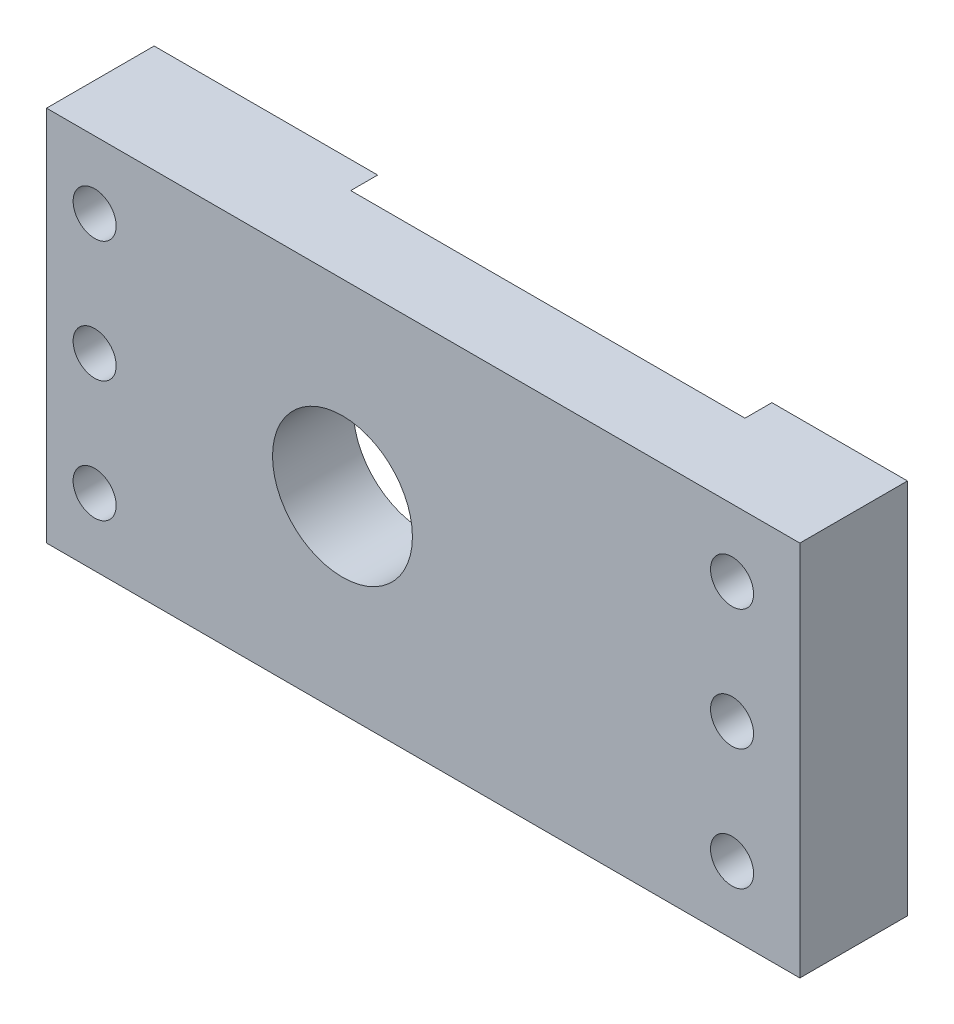
ISO-10303-21;
HEADER;
FILE_DESCRIPTION(('STEP AP214'),'2;1');
FILE_NAME('part.step','',(''),(''),'','','');
FILE_SCHEMA(('AUTOMOTIVE_DESIGN { 1 0 10303 214 1 1 1 1 }'));
ENDSEC;
DATA;
#1=APPLICATION_CONTEXT('core data for automotive mechanical design processes');
#2=APPLICATION_PROTOCOL_DEFINITION('international standard','automotive_design',2000,#1);
#3=PRODUCT_CONTEXT('',#1,'mechanical');
#4=PRODUCT('Part','Part','',(#3));
#5=PRODUCT_RELATED_PRODUCT_CATEGORY('part','',(#4));
#6=PRODUCT_DEFINITION_FORMATION('','',#4);
#7=PRODUCT_DEFINITION_CONTEXT('part definition',#1,'design');
#8=PRODUCT_DEFINITION('design','',#6,#7);
#9=PRODUCT_DEFINITION_SHAPE('','',#8);
#10=(LENGTH_UNIT() NAMED_UNIT(*) SI_UNIT(.MILLI.,.METRE.));
#11=(NAMED_UNIT(*) PLANE_ANGLE_UNIT() SI_UNIT($,.RADIAN.));
#12=(NAMED_UNIT(*) SI_UNIT($,.STERADIAN.) SOLID_ANGLE_UNIT());
#13=UNCERTAINTY_MEASURE_WITH_UNIT(LENGTH_MEASURE(1.E-05),#10,'distance_accuracy_value','');
#14=(GEOMETRIC_REPRESENTATION_CONTEXT(3) GLOBAL_UNCERTAINTY_ASSIGNED_CONTEXT((#13)) GLOBAL_UNIT_ASSIGNED_CONTEXT((#10,
#11,#12)) REPRESENTATION_CONTEXT('',''));
#15=CARTESIAN_POINT('',(0.,0.,0.));
#16=DIRECTION('',(0.,0.,1.));
#17=DIRECTION('',(1.,0.,0.));
#18=AXIS2_PLACEMENT_3D('',#15,#16,#17);
#19=CARTESIAN_POINT('',(0.,0.,-10.));
#20=DIRECTION('',(0.,0.,-1.));
#21=DIRECTION('',(-1.,0.,0.));
#22=AXIS2_PLACEMENT_3D('',#19,#20,#21);
#23=PLANE('',#22);
#24=CARTESIAN_POINT('',(-15.,0.,-10.));
#25=DIRECTION('',(0.,0.,-1.));
#26=DIRECTION('',(-1.,0.,0.));
#27=AXIS2_PLACEMENT_3D('',#24,#25,#26);
#28=CIRCLE('',#27,37.5);
#29=CARTESIAN_POINT('',(-28.4629120178363,-35.,-10.));
#30=VERTEX_POINT('',#29);
#31=CARTESIAN_POINT('',(-28.4629120178363,35.,-10.));
#32=VERTEX_POINT('',#31);
#33=EDGE_CURVE('E121',#30,#32,#28,.T.);
#34=ORIENTED_EDGE('',*,*,#33,.F.);
#35=DIRECTION('',(1.,0.,0.));
#36=VECTOR('',#35,1.);
#37=CARTESIAN_POINT('',(-70.,-35.,-10.));
#38=LINE('',#37,#36);
#39=CARTESIAN_POINT('',(-70.,-35.,-10.));
#40=VERTEX_POINT('',#39);
#41=EDGE_CURVE('E135',#40,#30,#38,.T.);
#42=ORIENTED_EDGE('',*,*,#41,.F.);
#43=DIRECTION('',(0.,-1.,0.));
#44=VECTOR('',#43,1.);
#45=CARTESIAN_POINT('',(-70.,-35.,-10.));
#46=LINE('',#45,#44);
#47=CARTESIAN_POINT('',(-70.,35.,-10.));
#48=VERTEX_POINT('',#47);
#49=EDGE_CURVE('E127',#48,#40,#46,.T.);
#50=ORIENTED_EDGE('',*,*,#49,.F.);
#51=DIRECTION('',(-1.,0.,0.));
#52=VECTOR('',#51,1.);
#53=CARTESIAN_POINT('',(-70.,35.,-10.));
#54=LINE('',#53,#52);
#55=EDGE_CURVE('E128',#32,#48,#54,.T.);
#56=ORIENTED_EDGE('',*,*,#55,.F.);
#57=EDGE_LOOP('',(#34,#42,#50,#56));
#58=FACE_BOUND('',#57,.T.);
#59=CARTESIAN_POINT('',(-61.06,22.5,-10.));
#60=DIRECTION('',(0.,0.,1.));
#61=DIRECTION('',(1.,0.,0.));
#62=AXIS2_PLACEMENT_3D('',#59,#60,#61);
#63=CIRCLE('',#62,4.00000000000001);
#64=CARTESIAN_POINT('',(-57.06,22.5,-10.));
#65=VERTEX_POINT('',#64);
#66=EDGE_CURVE('E172',#65,#65,#63,.T.);
#67=ORIENTED_EDGE('',*,*,#66,.T.);
#68=EDGE_LOOP('',(#67));
#69=FACE_BOUND('',#68,.T.);
#70=CARTESIAN_POINT('',(-61.06,0.,-10.));
#71=DIRECTION('',(0.,0.,1.));
#72=DIRECTION('',(1.,0.,0.));
#73=AXIS2_PLACEMENT_3D('',#70,#71,#72);
#74=CIRCLE('',#73,4.00000000000001);
#75=CARTESIAN_POINT('',(-57.06,0.,-10.));
#76=VERTEX_POINT('',#75);
#77=EDGE_CURVE('E178',#76,#76,#74,.T.);
#78=ORIENTED_EDGE('',*,*,#77,.T.);
#79=EDGE_LOOP('',(#78));
#80=FACE_BOUND('',#79,.T.);
#81=CARTESIAN_POINT('',(-61.06,-22.5,-10.));
#82=DIRECTION('',(0.,0.,1.));
#83=DIRECTION('',(-1.,0.,0.));
#84=AXIS2_PLACEMENT_3D('',#81,#82,#83);
#85=CIRCLE('',#84,4.00000000000001);
#86=CARTESIAN_POINT('',(-65.06,-22.5,-10.));
#87=VERTEX_POINT('',#86);
#88=EDGE_CURVE('E166',#87,#87,#85,.T.);
#89=ORIENTED_EDGE('',*,*,#88,.T.);
#90=EDGE_LOOP('',(#89));
#91=FACE_BOUND('',#90,.T.);
#92=ADVANCED_FACE('F33',(#58,#69,#80,#91),#23,.T.);
#93=CARTESIAN_POINT('',(-15.,0.,10.));
#94=DIRECTION('',(0.,0.,-1.));
#95=DIRECTION('',(-1.,0.,0.));
#96=AXIS2_PLACEMENT_3D('',#93,#94,#95);
#97=CYLINDRICAL_SURFACE('',#96,13.);
#98=CARTESIAN_POINT('',(-15.,0.,10.));
#99=DIRECTION('',(0.,0.,1.));
#100=DIRECTION('',(1.,0.,0.));
#101=AXIS2_PLACEMENT_3D('',#98,#99,#100);
#102=CIRCLE('',#101,13.);
#103=CARTESIAN_POINT('',(-2.00000000000003,0.,10.));
#104=VERTEX_POINT('',#103);
#105=EDGE_CURVE('E196',#104,#104,#102,.T.);
#106=ORIENTED_EDGE('',*,*,#105,.T.);
#107=EDGE_LOOP('',(#106));
#108=FACE_BOUND('',#107,.T.);
#109=CARTESIAN_POINT('',(-15.,0.,-5.));
#110=DIRECTION('',(0.,0.,-1.));
#111=DIRECTION('',(-1.,0.,0.));
#112=AXIS2_PLACEMENT_3D('',#109,#110,#111);
#113=CIRCLE('',#112,13.);
#114=CARTESIAN_POINT('',(-28.,0.,-5.));
#115=VERTEX_POINT('',#114);
#116=EDGE_CURVE('E148',#115,#115,#113,.T.);
#117=ORIENTED_EDGE('',*,*,#116,.T.);
#118=EDGE_LOOP('',(#117));
#119=FACE_BOUND('',#118,.T.);
#120=ADVANCED_FACE('F221',(#108,#119),#97,.F.);
#121=CARTESIAN_POINT('',(0.,0.,10.));
#122=DIRECTION('',(0.,0.,-1.));
#123=DIRECTION('',(-1.,0.,0.));
#124=AXIS2_PLACEMENT_3D('',#121,#122,#123);
#125=PLANE('',#124);
#126=DIRECTION('',(0.,1.,0.));
#127=VECTOR('',#126,1.);
#128=CARTESIAN_POINT('',(70.,-35.,10.));
#129=LINE('',#128,#127);
#130=CARTESIAN_POINT('',(70.,-35.,10.));
#131=VERTEX_POINT('',#130);
#132=CARTESIAN_POINT('',(70.,35.,10.));
#133=VERTEX_POINT('',#132);
#134=EDGE_CURVE('E138',#131,#133,#129,.T.);
#135=ORIENTED_EDGE('',*,*,#134,.T.);
#136=DIRECTION('',(-1.,0.,0.));
#137=VECTOR('',#136,1.);
#138=CARTESIAN_POINT('',(-70.,35.,10.));
#139=LINE('',#138,#137);
#140=CARTESIAN_POINT('',(-70.,35.,10.));
#141=VERTEX_POINT('',#140);
#142=EDGE_CURVE('E86',#133,#141,#139,.T.);
#143=ORIENTED_EDGE('',*,*,#142,.T.);
#144=DIRECTION('',(0.,-1.,0.));
#145=VECTOR('',#144,1.);
#146=CARTESIAN_POINT('',(-70.,-35.,10.));
#147=LINE('',#146,#145);
#148=CARTESIAN_POINT('',(-70.,-35.,10.));
#149=VERTEX_POINT('',#148);
#150=EDGE_CURVE('E203',#141,#149,#147,.T.);
#151=ORIENTED_EDGE('',*,*,#150,.T.);
#152=DIRECTION('',(1.,0.,0.));
#153=VECTOR('',#152,1.);
#154=CARTESIAN_POINT('',(-70.,-35.,10.));
#155=LINE('',#154,#153);
#156=EDGE_CURVE('E57',#149,#131,#155,.T.);
#157=ORIENTED_EDGE('',*,*,#156,.T.);
#158=EDGE_LOOP('',(#135,#143,#151,#157));
#159=FACE_BOUND('',#158,.T.);
#160=ORIENTED_EDGE('',*,*,#105,.F.);
#161=EDGE_LOOP('',(#160));
#162=FACE_BOUND('',#161,.T.);
#163=CARTESIAN_POINT('',(57.4,0.,10.));
#164=DIRECTION('',(0.,0.,1.));
#165=DIRECTION('',(1.,0.,0.));
#166=AXIS2_PLACEMENT_3D('',#163,#164,#165);
#167=CIRCLE('',#166,4.00000000000001);
#168=CARTESIAN_POINT('',(61.4,0.,10.));
#169=VERTEX_POINT('',#168);
#170=EDGE_CURVE('E193',#169,#169,#167,.T.);
#171=ORIENTED_EDGE('',*,*,#170,.F.);
#172=EDGE_LOOP('',(#171));
#173=FACE_BOUND('',#172,.T.);
#174=CARTESIAN_POINT('',(57.4,22.5,10.));
#175=DIRECTION('',(0.,0.,1.));
#176=DIRECTION('',(1.,0.,0.));
#177=AXIS2_PLACEMENT_3D('',#174,#175,#176);
#178=CIRCLE('',#177,4.00000000000001);
#179=CARTESIAN_POINT('',(61.4,22.5,10.));
#180=VERTEX_POINT('',#179);
#181=EDGE_CURVE('E187',#180,#180,#178,.T.);
#182=ORIENTED_EDGE('',*,*,#181,.F.);
#183=EDGE_LOOP('',(#182));
#184=FACE_BOUND('',#183,.T.);
#185=CARTESIAN_POINT('',(-61.06,0.,10.));
#186=DIRECTION('',(0.,0.,1.));
#187=DIRECTION('',(1.,0.,0.));
#188=AXIS2_PLACEMENT_3D('',#185,#186,#187);
#189=CIRCLE('',#188,4.00000000000001);
#190=CARTESIAN_POINT('',(-57.06,0.,10.));
#191=VERTEX_POINT('',#190);
#192=EDGE_CURVE('E181',#191,#191,#189,.T.);
#193=ORIENTED_EDGE('',*,*,#192,.F.);
#194=EDGE_LOOP('',(#193));
#195=FACE_BOUND('',#194,.T.);
#196=CARTESIAN_POINT('',(-61.06,22.5,10.));
#197=DIRECTION('',(0.,0.,1.));
#198=DIRECTION('',(1.,0.,0.));
#199=AXIS2_PLACEMENT_3D('',#196,#197,#198);
#200=CIRCLE('',#199,4.00000000000001);
#201=CARTESIAN_POINT('',(-57.06,22.5,10.));
#202=VERTEX_POINT('',#201);
#203=EDGE_CURVE('E175',#202,#202,#200,.T.);
#204=ORIENTED_EDGE('',*,*,#203,.F.);
#205=EDGE_LOOP('',(#204));
#206=FACE_BOUND('',#205,.T.);
#207=CARTESIAN_POINT('',(-61.06,-22.5,10.));
#208=DIRECTION('',(0.,0.,1.));
#209=DIRECTION('',(-1.,0.,0.));
#210=AXIS2_PLACEMENT_3D('',#207,#208,#209);
#211=CIRCLE('',#210,4.00000000000001);
#212=CARTESIAN_POINT('',(-65.06,-22.5,10.));
#213=VERTEX_POINT('',#212);
#214=EDGE_CURVE('E169',#213,#213,#211,.T.);
#215=ORIENTED_EDGE('',*,*,#214,.F.);
#216=EDGE_LOOP('',(#215));
#217=FACE_BOUND('',#216,.T.);
#218=CARTESIAN_POINT('',(57.4,-22.5,10.));
#219=DIRECTION('',(0.,0.,1.));
#220=DIRECTION('',(-1.,0.,0.));
#221=AXIS2_PLACEMENT_3D('',#218,#219,#220);
#222=CIRCLE('',#221,4.00000000000001);
#223=CARTESIAN_POINT('',(53.4,-22.5,10.));
#224=VERTEX_POINT('',#223);
#225=EDGE_CURVE('E163',#224,#224,#222,.T.);
#226=ORIENTED_EDGE('',*,*,#225,.F.);
#227=EDGE_LOOP('',(#226));
#228=FACE_BOUND('',#227,.T.);
#229=ADVANCED_FACE('F206',(#159,#162,#173,#184,#195,#206,#217,#228),#125,.F.);
#230=DIRECTION('',(0.,-1.,0.));
#231=VECTOR('',#230,1.);
#232=CARTESIAN_POINT('',(44.8,-37.5,-10.));
#233=LINE('',#232,#231);
#234=CARTESIAN_POINT('',(44.8,35.,-10.));
#235=VERTEX_POINT('',#234);
#236=CARTESIAN_POINT('',(44.8,-35.,-10.));
#237=VERTEX_POINT('',#236);
#238=EDGE_CURVE('E110',#235,#237,#233,.T.);
#239=ORIENTED_EDGE('',*,*,#238,.F.);
#240=CARTESIAN_POINT('',(70.,35.,-10.));
#241=VERTEX_POINT('',#240);
#242=EDGE_CURVE('E120',#241,#235,#54,.T.);
#243=ORIENTED_EDGE('',*,*,#242,.F.);
#244=DIRECTION('',(0.,1.,0.));
#245=VECTOR('',#244,1.);
#246=CARTESIAN_POINT('',(70.,-35.,-10.));
#247=LINE('',#246,#245);
#248=CARTESIAN_POINT('',(70.,-35.,-10.));
#249=VERTEX_POINT('',#248);
#250=EDGE_CURVE('E131',#249,#241,#247,.T.);
#251=ORIENTED_EDGE('',*,*,#250,.F.);
#252=EDGE_CURVE('E78',#237,#249,#38,.T.);
#253=ORIENTED_EDGE('',*,*,#252,.F.);
#254=EDGE_LOOP('',(#239,#243,#251,#253));
#255=FACE_BOUND('',#254,.T.);
#256=CARTESIAN_POINT('',(57.4,0.,-10.));
#257=DIRECTION('',(0.,0.,1.));
#258=DIRECTION('',(1.,0.,0.));
#259=AXIS2_PLACEMENT_3D('',#256,#257,#258);
#260=CIRCLE('',#259,4.00000000000001);
#261=CARTESIAN_POINT('',(61.4,0.,-10.));
#262=VERTEX_POINT('',#261);
#263=EDGE_CURVE('E190',#262,#262,#260,.T.);
#264=ORIENTED_EDGE('',*,*,#263,.T.);
#265=EDGE_LOOP('',(#264));
#266=FACE_BOUND('',#265,.T.);
#267=CARTESIAN_POINT('',(57.4,22.5,-10.));
#268=DIRECTION('',(0.,0.,1.));
#269=DIRECTION('',(1.,0.,0.));
#270=AXIS2_PLACEMENT_3D('',#267,#268,#269);
#271=CIRCLE('',#270,4.00000000000001);
#272=CARTESIAN_POINT('',(61.4,22.5,-10.));
#273=VERTEX_POINT('',#272);
#274=EDGE_CURVE('E184',#273,#273,#271,.T.);
#275=ORIENTED_EDGE('',*,*,#274,.T.);
#276=EDGE_LOOP('',(#275));
#277=FACE_BOUND('',#276,.T.);
#278=CARTESIAN_POINT('',(57.4,-22.5,-10.));
#279=DIRECTION('',(0.,0.,1.));
#280=DIRECTION('',(-1.,0.,0.));
#281=AXIS2_PLACEMENT_3D('',#278,#279,#280);
#282=CIRCLE('',#281,4.00000000000001);
#283=CARTESIAN_POINT('',(53.4,-22.5,-10.));
#284=VERTEX_POINT('',#283);
#285=EDGE_CURVE('E162',#284,#284,#282,.T.);
#286=ORIENTED_EDGE('',*,*,#285,.T.);
#287=EDGE_LOOP('',(#286));
#288=FACE_BOUND('',#287,.T.);
#289=ADVANCED_FACE('F117',(#255,#266,#277,#288),#23,.T.);
#290=CARTESIAN_POINT('',(70.,-35.,10.));
#291=DIRECTION('',(-1.,0.,0.));
#292=DIRECTION('',(0.,0.,1.));
#293=AXIS2_PLACEMENT_3D('',#290,#291,#292);
#294=PLANE('',#293);
#295=ORIENTED_EDGE('',*,*,#250,.T.);
#296=DIRECTION('',(0.,0.,-1.));
#297=VECTOR('',#296,1.);
#298=CARTESIAN_POINT('',(70.,35.,10.));
#299=LINE('',#298,#297);
#300=EDGE_CURVE('E125',#133,#241,#299,.T.);
#301=ORIENTED_EDGE('',*,*,#300,.F.);
#302=ORIENTED_EDGE('',*,*,#134,.F.);
#303=DIRECTION('',(0.,0.,-1.));
#304=VECTOR('',#303,1.);
#305=CARTESIAN_POINT('',(70.,-35.,10.));
#306=LINE('',#305,#304);
#307=EDGE_CURVE('E139',#131,#249,#306,.T.);
#308=ORIENTED_EDGE('',*,*,#307,.T.);
#309=EDGE_LOOP('',(#295,#301,#302,#308));
#310=FACE_BOUND('',#309,.T.);
#311=ADVANCED_FACE('F35',(#310),#294,.F.);
#312=CARTESIAN_POINT('',(-70.,35.,10.));
#313=DIRECTION('',(0.,-1.,0.));
#314=DIRECTION('',(0.,0.,-1.));
#315=AXIS2_PLACEMENT_3D('',#312,#313,#314);
#316=PLANE('',#315);
#317=DIRECTION('',(1.,0.,0.));
#318=VECTOR('',#317,1.);
#319=CARTESIAN_POINT('',(-70.,35.,-5.));
#320=LINE('',#319,#318);
#321=CARTESIAN_POINT('',(-28.4629120178363,35.,-5.));
#322=VERTEX_POINT('',#321);
#323=CARTESIAN_POINT('',(44.8,35.,-5.));
#324=VERTEX_POINT('',#323);
#325=EDGE_CURVE('E114',#322,#324,#320,.T.);
#326=ORIENTED_EDGE('',*,*,#325,.F.);
#327=DIRECTION('',(0.,0.,-1.));
#328=VECTOR('',#327,1.);
#329=CARTESIAN_POINT('',(-28.4629120178363,35.,-5.));
#330=LINE('',#329,#328);
#331=EDGE_CURVE('E113',#322,#32,#330,.T.);
#332=ORIENTED_EDGE('',*,*,#331,.T.);
#333=ORIENTED_EDGE('',*,*,#55,.T.);
#334=DIRECTION('',(0.,0.,-1.));
#335=VECTOR('',#334,1.);
#336=CARTESIAN_POINT('',(-70.,35.,10.));
#337=LINE('',#336,#335);
#338=EDGE_CURVE('E144',#141,#48,#337,.T.);
#339=ORIENTED_EDGE('',*,*,#338,.F.);
#340=ORIENTED_EDGE('',*,*,#142,.F.);
#341=ORIENTED_EDGE('',*,*,#300,.T.);
#342=ORIENTED_EDGE('',*,*,#242,.T.);
#343=DIRECTION('',(0.,0.,1.));
#344=VECTOR('',#343,1.);
#345=CARTESIAN_POINT('',(44.8,35.,10.));
#346=LINE('',#345,#344);
#347=EDGE_CURVE('E107',#235,#324,#346,.T.);
#348=ORIENTED_EDGE('',*,*,#347,.T.);
#349=EDGE_LOOP('',(#326,#332,#333,#339,#340,#341,#342,#348));
#350=FACE_BOUND('',#349,.T.);
#351=ADVANCED_FACE('F123',(#350),#316,.F.);
#352=CARTESIAN_POINT('',(-70.,-35.,10.));
#353=DIRECTION('',(1.,0.,0.));
#354=DIRECTION('',(0.,0.,-1.));
#355=AXIS2_PLACEMENT_3D('',#352,#353,#354);
#356=PLANE('',#355);
#357=ORIENTED_EDGE('',*,*,#49,.T.);
#358=DIRECTION('',(0.,0.,-1.));
#359=VECTOR('',#358,1.);
#360=CARTESIAN_POINT('',(-70.,-35.,10.));
#361=LINE('',#360,#359);
#362=EDGE_CURVE('E141',#149,#40,#361,.T.);
#363=ORIENTED_EDGE('',*,*,#362,.F.);
#364=ORIENTED_EDGE('',*,*,#150,.F.);
#365=ORIENTED_EDGE('',*,*,#338,.T.);
#366=EDGE_LOOP('',(#357,#363,#364,#365));
#367=FACE_BOUND('',#366,.T.);
#368=ADVANCED_FACE('F209',(#367),#356,.F.);
#369=CARTESIAN_POINT('',(-70.,-35.,10.));
#370=DIRECTION('',(0.,1.,0.));
#371=DIRECTION('',(0.,0.,1.));
#372=AXIS2_PLACEMENT_3D('',#369,#370,#371);
#373=PLANE('',#372);
#374=ORIENTED_EDGE('',*,*,#41,.T.);
#375=DIRECTION('',(0.,0.,-1.));
#376=VECTOR('',#375,1.);
#377=CARTESIAN_POINT('',(-28.4629120178363,-35.,-5.));
#378=LINE('',#377,#376);
#379=CARTESIAN_POINT('',(-28.4629120178363,-35.,-5.));
#380=VERTEX_POINT('',#379);
#381=EDGE_CURVE('E11',#30,#380,#378,.F.);
#382=ORIENTED_EDGE('',*,*,#381,.T.);
#383=DIRECTION('',(-1.,0.,0.));
#384=VECTOR('',#383,1.);
#385=CARTESIAN_POINT('',(-70.,-35.,-5.));
#386=LINE('',#385,#384);
#387=CARTESIAN_POINT('',(44.8,-35.,-5.));
#388=VERTEX_POINT('',#387);
#389=EDGE_CURVE('E150',#388,#380,#386,.T.);
#390=ORIENTED_EDGE('',*,*,#389,.F.);
#391=DIRECTION('',(0.,0.,-1.));
#392=VECTOR('',#391,1.);
#393=CARTESIAN_POINT('',(44.8,-35.,10.));
#394=LINE('',#393,#392);
#395=EDGE_CURVE('E41',#388,#237,#394,.T.);
#396=ORIENTED_EDGE('',*,*,#395,.T.);
#397=ORIENTED_EDGE('',*,*,#252,.T.);
#398=ORIENTED_EDGE('',*,*,#307,.F.);
#399=ORIENTED_EDGE('',*,*,#156,.F.);
#400=ORIENTED_EDGE('',*,*,#362,.T.);
#401=EDGE_LOOP('',(#374,#382,#390,#396,#397,#398,#399,#400));
#402=FACE_BOUND('',#401,.T.);
#403=ADVANCED_FACE('F153',(#402),#373,.F.);
#404=CARTESIAN_POINT('',(57.4,0.,10.));
#405=DIRECTION('',(0.,0.,-1.));
#406=DIRECTION('',(-1.,0.,0.));
#407=AXIS2_PLACEMENT_3D('',#404,#405,#406);
#408=CYLINDRICAL_SURFACE('',#407,4.00000000000001);
#409=ORIENTED_EDGE('',*,*,#170,.T.);
#410=EDGE_LOOP('',(#409));
#411=FACE_BOUND('',#410,.T.);
#412=ORIENTED_EDGE('',*,*,#263,.F.);
#413=EDGE_LOOP('',(#412));
#414=FACE_BOUND('',#413,.T.);
#415=ADVANCED_FACE('F234',(#411,#414),#408,.F.);
#416=CARTESIAN_POINT('',(57.4,22.5,10.));
#417=DIRECTION('',(0.,0.,-1.));
#418=DIRECTION('',(-1.,0.,0.));
#419=AXIS2_PLACEMENT_3D('',#416,#417,#418);
#420=CYLINDRICAL_SURFACE('',#419,4.00000000000001);
#421=ORIENTED_EDGE('',*,*,#181,.T.);
#422=EDGE_LOOP('',(#421));
#423=FACE_BOUND('',#422,.T.);
#424=ORIENTED_EDGE('',*,*,#274,.F.);
#425=EDGE_LOOP('',(#424));
#426=FACE_BOUND('',#425,.T.);
#427=ADVANCED_FACE('F251',(#423,#426),#420,.F.);
#428=CARTESIAN_POINT('',(-61.06,0.,10.));
#429=DIRECTION('',(0.,0.,-1.));
#430=DIRECTION('',(-1.,0.,0.));
#431=AXIS2_PLACEMENT_3D('',#428,#429,#430);
#432=CYLINDRICAL_SURFACE('',#431,4.00000000000001);
#433=ORIENTED_EDGE('',*,*,#192,.T.);
#434=EDGE_LOOP('',(#433));
#435=FACE_BOUND('',#434,.T.);
#436=ORIENTED_EDGE('',*,*,#77,.F.);
#437=EDGE_LOOP('',(#436));
#438=FACE_BOUND('',#437,.T.);
#439=ADVANCED_FACE('F259',(#435,#438),#432,.F.);
#440=CARTESIAN_POINT('',(-61.06,22.5,10.));
#441=DIRECTION('',(0.,0.,-1.));
#442=DIRECTION('',(-1.,0.,0.));
#443=AXIS2_PLACEMENT_3D('',#440,#441,#442);
#444=CYLINDRICAL_SURFACE('',#443,4.00000000000001);
#445=ORIENTED_EDGE('',*,*,#203,.T.);
#446=EDGE_LOOP('',(#445));
#447=FACE_BOUND('',#446,.T.);
#448=ORIENTED_EDGE('',*,*,#66,.F.);
#449=EDGE_LOOP('',(#448));
#450=FACE_BOUND('',#449,.T.);
#451=ADVANCED_FACE('F267',(#447,#450),#444,.F.);
#452=CARTESIAN_POINT('',(-61.06,-22.5,10.));
#453=DIRECTION('',(0.,0.,-1.));
#454=DIRECTION('',(-1.,0.,0.));
#455=AXIS2_PLACEMENT_3D('',#452,#453,#454);
#456=CYLINDRICAL_SURFACE('',#455,4.00000000000001);
#457=ORIENTED_EDGE('',*,*,#214,.T.);
#458=EDGE_LOOP('',(#457));
#459=FACE_BOUND('',#458,.T.);
#460=ORIENTED_EDGE('',*,*,#88,.F.);
#461=EDGE_LOOP('',(#460));
#462=FACE_BOUND('',#461,.T.);
#463=ADVANCED_FACE('F275',(#459,#462),#456,.F.);
#464=CARTESIAN_POINT('',(57.4,-22.5,10.));
#465=DIRECTION('',(0.,0.,-1.));
#466=DIRECTION('',(-1.,0.,0.));
#467=AXIS2_PLACEMENT_3D('',#464,#465,#466);
#468=CYLINDRICAL_SURFACE('',#467,4.00000000000001);
#469=ORIENTED_EDGE('',*,*,#225,.T.);
#470=EDGE_LOOP('',(#469));
#471=FACE_BOUND('',#470,.T.);
#472=ORIENTED_EDGE('',*,*,#285,.F.);
#473=EDGE_LOOP('',(#472));
#474=FACE_BOUND('',#473,.T.);
#475=ADVANCED_FACE('F283',(#471,#474),#468,.F.);
#476=CARTESIAN_POINT('',(-15.,0.,-5.));
#477=DIRECTION('',(0.,0.,-1.));
#478=DIRECTION('',(-1.,0.,0.));
#479=AXIS2_PLACEMENT_3D('',#476,#477,#478);
#480=CYLINDRICAL_SURFACE('',#479,37.5);
#481=CARTESIAN_POINT('',(-15.,0.,-5.));
#482=DIRECTION('',(0.,0.,-1.));
#483=DIRECTION('',(-1.,0.,0.));
#484=AXIS2_PLACEMENT_3D('',#481,#482,#483);
#485=CIRCLE('',#484,37.5);
#486=EDGE_CURVE('E151',#380,#322,#485,.T.);
#487=ORIENTED_EDGE('',*,*,#486,.F.);
#488=ORIENTED_EDGE('',*,*,#381,.F.);
#489=ORIENTED_EDGE('',*,*,#33,.T.);
#490=ORIENTED_EDGE('',*,*,#331,.F.);
#491=EDGE_LOOP('',(#487,#488,#489,#490));
#492=FACE_BOUND('',#491,.T.);
#493=ADVANCED_FACE('F291',(#492),#480,.F.);
#494=CARTESIAN_POINT('',(44.8,-37.5,-5.));
#495=DIRECTION('',(1.,0.,0.));
#496=DIRECTION('',(0.,0.,-1.));
#497=AXIS2_PLACEMENT_3D('',#494,#495,#496);
#498=PLANE('',#497);
#499=ORIENTED_EDGE('',*,*,#238,.T.);
#500=ORIENTED_EDGE('',*,*,#395,.F.);
#501=DIRECTION('',(0.,-1.,0.));
#502=VECTOR('',#501,1.);
#503=CARTESIAN_POINT('',(44.8,-37.5,-5.));
#504=LINE('',#503,#502);
#505=EDGE_CURVE('E48',#324,#388,#504,.T.);
#506=ORIENTED_EDGE('',*,*,#505,.F.);
#507=ORIENTED_EDGE('',*,*,#347,.F.);
#508=EDGE_LOOP('',(#499,#500,#506,#507));
#509=FACE_BOUND('',#508,.T.);
#510=ADVANCED_FACE('F109',(#509),#498,.F.);
#511=CARTESIAN_POINT('',(-15.,0.,-5.));
#512=DIRECTION('',(0.,0.,-1.));
#513=DIRECTION('',(-1.,0.,0.));
#514=AXIS2_PLACEMENT_3D('',#511,#512,#513);
#515=PLANE('',#514);
#516=ORIENTED_EDGE('',*,*,#116,.F.);
#517=EDGE_LOOP('',(#516));
#518=FACE_BOUND('',#517,.T.);
#519=ORIENTED_EDGE('',*,*,#325,.T.);
#520=ORIENTED_EDGE('',*,*,#505,.T.);
#521=ORIENTED_EDGE('',*,*,#389,.T.);
#522=ORIENTED_EDGE('',*,*,#486,.T.);
#523=EDGE_LOOP('',(#519,#520,#521,#522));
#524=FACE_BOUND('',#523,.T.);
#525=ADVANCED_FACE('F305',(#518,#524),#515,.T.);
#526=CLOSED_SHELL('',(#92,#120,#229,#289,#311,#351,#368,#403,#415,#427,#439,#451,#463,#475,#493,
#510,#525));
#527=MANIFOLD_SOLID_BREP('B2',#526);
#528=ADVANCED_BREP_SHAPE_REPRESENTATION('',(#18,#527),#14);
#529=SHAPE_DEFINITION_REPRESENTATION(#9,#528);
ENDSEC;
END-ISO-10303-21;
